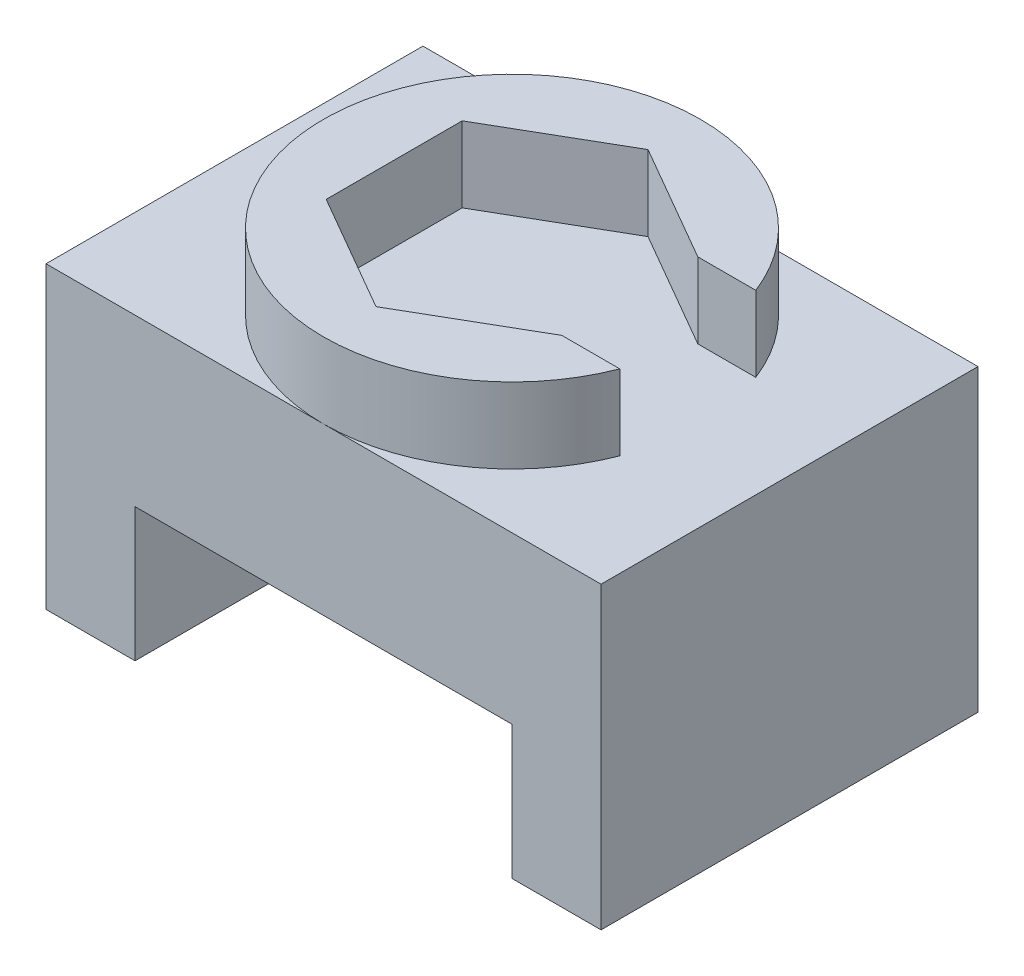
ISO-10303-21;
HEADER;
FILE_DESCRIPTION(('STEP AP214'),'2;1');
FILE_NAME('part.step','',(''),(''),'','','');
FILE_SCHEMA(('AUTOMOTIVE_DESIGN { 1 0 10303 214 1 1 1 1 }'));
ENDSEC;
DATA;
#1=APPLICATION_CONTEXT('core data for automotive mechanical design processes');
#2=APPLICATION_PROTOCOL_DEFINITION('international standard','automotive_design',2000,#1);
#3=PRODUCT_CONTEXT('',#1,'mechanical');
#4=PRODUCT('Part','Part','',(#3));
#5=PRODUCT_RELATED_PRODUCT_CATEGORY('part','',(#4));
#6=PRODUCT_DEFINITION_FORMATION('','',#4);
#7=PRODUCT_DEFINITION_CONTEXT('part definition',#1,'design');
#8=PRODUCT_DEFINITION('design','',#6,#7);
#9=PRODUCT_DEFINITION_SHAPE('','',#8);
#10=(LENGTH_UNIT() NAMED_UNIT(*) SI_UNIT(.MILLI.,.METRE.));
#11=(NAMED_UNIT(*) PLANE_ANGLE_UNIT() SI_UNIT($,.RADIAN.));
#12=(NAMED_UNIT(*) SI_UNIT($,.STERADIAN.) SOLID_ANGLE_UNIT());
#13=UNCERTAINTY_MEASURE_WITH_UNIT(LENGTH_MEASURE(1.E-05),#10,'distance_accuracy_value','');
#14=(GEOMETRIC_REPRESENTATION_CONTEXT(3) GLOBAL_UNCERTAINTY_ASSIGNED_CONTEXT((#13)) GLOBAL_UNIT_ASSIGNED_CONTEXT((#10,
#11,#12)) REPRESENTATION_CONTEXT('',''));
#15=CARTESIAN_POINT('',(0.,0.,0.));
#16=DIRECTION('',(0.,0.,1.));
#17=DIRECTION('',(1.,0.,0.));
#18=AXIS2_PLACEMENT_3D('',#15,#16,#17);
#19=CARTESIAN_POINT('',(21.2104651162791,20.17346,25.4));
#20=DIRECTION('',(0.,-1.,0.));
#21=DIRECTION('',(1.,0.,0.));
#22=AXIS2_PLACEMENT_3D('',#19,#20,#21);
#23=PLANE('',#22);
#24=CARTESIAN_POINT('',(2.51046511627907,20.17346,12.7));
#25=DIRECTION('',(0.,1.,0.));
#26=DIRECTION('',(-1.,0.,0.));
#27=AXIS2_PLACEMENT_3D('',#24,#25,#26);
#28=CIRCLE('',#27,12.7);
#29=CARTESIAN_POINT('',(14.3548181132421,20.17346,8.11728223830734));
#30=VERTEX_POINT('',#29);
#31=CARTESIAN_POINT('',(2.51046511627907,20.17346,0.));
#32=VERTEX_POINT('',#31);
#33=EDGE_CURVE('E50',#30,#32,#28,.T.);
#34=ORIENTED_EDGE('',*,*,#33,.F.);
#35=DIRECTION('',(-1.,0.,0.));
#36=VECTOR('',#35,1.);
#37=CARTESIAN_POINT('',(0.,20.17346,8.11728223830734));
#38=LINE('',#37,#36);
#39=CARTESIAN_POINT('',(10.4479651162791,20.17346,8.11728223830734));
#40=VERTEX_POINT('',#39);
#41=EDGE_CURVE('E61',#30,#40,#38,.T.);
#42=ORIENTED_EDGE('',*,*,#41,.T.);
#43=DIRECTION('',(-0.866025403784439,0.,-0.5));
#44=VECTOR('',#43,1.);
#45=CARTESIAN_POINT('',(-0.902895034961415,20.17346,1.56386007445484));
#46=LINE('',#45,#44);
#47=CARTESIAN_POINT('',(2.51046511627908,20.17346,3.53456447661468));
#48=VERTEX_POINT('',#47);
#49=EDGE_CURVE('E264',#40,#48,#46,.T.);
#50=ORIENTED_EDGE('',*,*,#49,.T.);
#51=DIRECTION('',(-0.866025403784439,0.,0.5));
#52=VECTOR('',#51,1.);
#53=CARTESIAN_POINT('',(2.15812759310095,20.17346,3.73798664046718));
#54=LINE('',#53,#52);
#55=CARTESIAN_POINT('',(-5.42703488372092,20.17346,8.11728223830733));
#56=VERTEX_POINT('',#55);
#57=EDGE_CURVE('E262',#48,#56,#54,.T.);
#58=ORIENTED_EDGE('',*,*,#57,.T.);
#59=DIRECTION('',(0.,0.,1.));
#60=VECTOR('',#59,1.);
#61=CARTESIAN_POINT('',(-5.42703488372092,20.17346,0.));
#62=LINE('',#61,#60);
#63=CARTESIAN_POINT('',(-5.42703488372092,20.17346,17.2827177616926));
#64=VERTEX_POINT('',#63);
#65=EDGE_CURVE('E260',#56,#64,#62,.T.);
#66=ORIENTED_EDGE('',*,*,#65,.T.);
#67=DIRECTION('',(0.866025403784439,0.,0.5));
#68=VECTOR('',#67,1.);
#69=CARTESIAN_POINT('',(-8.84039503496141,20.17346,15.3120133595328));
#70=LINE('',#69,#68);
#71=CARTESIAN_POINT('',(2.51046511627908,20.17346,21.8654355233853));
#72=VERTEX_POINT('',#71);
#73=EDGE_CURVE('E256',#64,#72,#70,.T.);
#74=ORIENTED_EDGE('',*,*,#73,.T.);
#75=DIRECTION('',(0.866025403784439,0.,-0.5));
#76=VECTOR('',#75,1.);
#77=CARTESIAN_POINT('',(10.095627593101,20.17346,17.4861399255452));
#78=LINE('',#77,#76);
#79=CARTESIAN_POINT('',(10.4479651162791,20.17346,17.2827177616927));
#80=VERTEX_POINT('',#79);
#81=EDGE_CURVE('E255',#72,#80,#78,.T.);
#82=ORIENTED_EDGE('',*,*,#81,.T.);
#83=DIRECTION('',(-1.,0.,0.));
#84=VECTOR('',#83,1.);
#85=CARTESIAN_POINT('',(0.,20.17346,17.2827177616927));
#86=LINE('',#85,#84);
#87=CARTESIAN_POINT('',(14.3548181132421,20.17346,17.2827177616927));
#88=VERTEX_POINT('',#87);
#89=EDGE_CURVE('E254',#88,#80,#86,.T.);
#90=ORIENTED_EDGE('',*,*,#89,.F.);
#91=CARTESIAN_POINT('',(2.51046511627907,20.17346,25.4));
#92=VERTEX_POINT('',#91);
#93=EDGE_CURVE('E48',#92,#88,#28,.T.);
#94=ORIENTED_EDGE('',*,*,#93,.F.);
#95=DIRECTION('',(-1.,0.,0.));
#96=VECTOR('',#95,1.);
#97=CARTESIAN_POINT('',(21.2104651162791,20.17346,25.4));
#98=LINE('',#97,#96);
#99=CARTESIAN_POINT('',(21.2104651162791,20.17346,25.4));
#100=VERTEX_POINT('',#99);
#101=EDGE_CURVE('E208',#100,#92,#98,.T.);
#102=ORIENTED_EDGE('',*,*,#101,.F.);
#103=DIRECTION('',(0.,0.,-1.));
#104=VECTOR('',#103,1.);
#105=CARTESIAN_POINT('',(21.2104651162791,20.17346,25.4));
#106=LINE('',#105,#104);
#107=CARTESIAN_POINT('',(21.2104651162791,20.17346,0.));
#108=VERTEX_POINT('',#107);
#109=EDGE_CURVE('E232',#100,#108,#106,.T.);
#110=ORIENTED_EDGE('',*,*,#109,.T.);
#111=DIRECTION('',(-1.,0.,0.));
#112=VECTOR('',#111,1.);
#113=CARTESIAN_POINT('',(21.2104651162791,20.17346,0.));
#114=LINE('',#113,#112);
#115=EDGE_CURVE('E224',#108,#32,#114,.T.);
#116=ORIENTED_EDGE('',*,*,#115,.T.);
#117=EDGE_LOOP('',(#34,#42,#50,#58,#66,#74,#82,#90,#94,#102,#110,#116));
#118=FACE_BOUND('',#117,.T.);
#119=ADVANCED_FACE('F39',(#118),#23,.F.);
#120=EDGE_CURVE('E11',#32,#92,#28,.T.);
#121=ORIENTED_EDGE('',*,*,#120,.F.);
#122=CARTESIAN_POINT('',(-16.1895348837209,20.17346,0.));
#123=VERTEX_POINT('',#122);
#124=EDGE_CURVE('E223',#32,#123,#114,.T.);
#125=ORIENTED_EDGE('',*,*,#124,.T.);
#126=DIRECTION('',(0.,0.,-1.));
#127=VECTOR('',#126,1.);
#128=CARTESIAN_POINT('',(-16.1895348837209,20.17346,25.4));
#129=LINE('',#128,#127);
#130=CARTESIAN_POINT('',(-16.1895348837209,20.17346,25.4));
#131=VERTEX_POINT('',#130);
#132=EDGE_CURVE('E229',#131,#123,#129,.T.);
#133=ORIENTED_EDGE('',*,*,#132,.F.);
#134=EDGE_CURVE('E207',#92,#131,#98,.T.);
#135=ORIENTED_EDGE('',*,*,#134,.F.);
#136=EDGE_LOOP('',(#121,#125,#133,#135));
#137=FACE_BOUND('',#136,.T.);
#138=ADVANCED_FACE('F322',(#137),#23,.F.);
#139=CARTESIAN_POINT('',(-16.1895348837209,0.,25.4));
#140=DIRECTION('',(0.,1.,0.));
#141=DIRECTION('',(0.,0.,1.));
#142=AXIS2_PLACEMENT_3D('',#139,#140,#141);
#143=PLANE('',#142);
#144=DIRECTION('',(1.,0.,0.));
#145=VECTOR('',#144,1.);
#146=CARTESIAN_POINT('',(-16.1895348837209,0.,0.));
#147=LINE('',#146,#145);
#148=CARTESIAN_POINT('',(-16.1895348837209,0.,0.));
#149=VERTEX_POINT('',#148);
#150=CARTESIAN_POINT('',(-10.1895348837209,0.,0.));
#151=VERTEX_POINT('',#150);
#152=EDGE_CURVE('E184',#149,#151,#147,.T.);
#153=ORIENTED_EDGE('',*,*,#152,.T.);
#154=DIRECTION('',(0.,0.,-1.));
#155=VECTOR('',#154,1.);
#156=CARTESIAN_POINT('',(-10.1895348837209,0.,25.4));
#157=LINE('',#156,#155);
#158=CARTESIAN_POINT('',(-10.1895348837209,0.,25.4));
#159=VERTEX_POINT('',#158);
#160=EDGE_CURVE('E43',#159,#151,#157,.T.);
#161=ORIENTED_EDGE('',*,*,#160,.F.);
#162=DIRECTION('',(1.,0.,0.));
#163=VECTOR('',#162,1.);
#164=CARTESIAN_POINT('',(-16.1895348837209,0.,25.4));
#165=LINE('',#164,#163);
#166=CARTESIAN_POINT('',(-16.1895348837209,0.,25.4));
#167=VERTEX_POINT('',#166);
#168=EDGE_CURVE('E193',#167,#159,#165,.T.);
#169=ORIENTED_EDGE('',*,*,#168,.F.);
#170=DIRECTION('',(0.,0.,-1.));
#171=VECTOR('',#170,1.);
#172=CARTESIAN_POINT('',(-16.1895348837209,0.,25.4));
#173=LINE('',#172,#171);
#174=EDGE_CURVE('E212',#167,#149,#173,.T.);
#175=ORIENTED_EDGE('',*,*,#174,.T.);
#176=EDGE_LOOP('',(#153,#161,#169,#175));
#177=FACE_BOUND('',#176,.T.);
#178=ADVANCED_FACE('F41',(#177),#143,.F.);
#179=CARTESIAN_POINT('',(-10.1895348837209,0.,25.4));
#180=DIRECTION('',(-1.,0.,0.));
#181=DIRECTION('',(0.,0.,1.));
#182=AXIS2_PLACEMENT_3D('',#179,#180,#181);
#183=PLANE('',#182);
#184=DIRECTION('',(0.,1.,0.));
#185=VECTOR('',#184,1.);
#186=CARTESIAN_POINT('',(-10.1895348837209,0.,0.));
#187=LINE('',#186,#185);
#188=CARTESIAN_POINT('',(-10.1895348837209,9.,0.));
#189=VERTEX_POINT('',#188);
#190=EDGE_CURVE('E187',#151,#189,#187,.T.);
#191=ORIENTED_EDGE('',*,*,#190,.T.);
#192=DIRECTION('',(0.,0.,-1.));
#193=VECTOR('',#192,1.);
#194=CARTESIAN_POINT('',(-10.1895348837209,9.,25.4));
#195=LINE('',#194,#193);
#196=CARTESIAN_POINT('',(-10.1895348837209,9.,25.4));
#197=VERTEX_POINT('',#196);
#198=EDGE_CURVE('E243',#197,#189,#195,.T.);
#199=ORIENTED_EDGE('',*,*,#198,.F.);
#200=DIRECTION('',(0.,1.,0.));
#201=VECTOR('',#200,1.);
#202=CARTESIAN_POINT('',(-10.1895348837209,0.,25.4));
#203=LINE('',#202,#201);
#204=EDGE_CURVE('E196',#159,#197,#203,.T.);
#205=ORIENTED_EDGE('',*,*,#204,.F.);
#206=ORIENTED_EDGE('',*,*,#160,.T.);
#207=EDGE_LOOP('',(#191,#199,#205,#206));
#208=FACE_BOUND('',#207,.T.);
#209=ADVANCED_FACE('F346',(#208),#183,.F.);
#210=CARTESIAN_POINT('',(-10.1895348837209,9.,25.4));
#211=DIRECTION('',(0.,1.,0.));
#212=DIRECTION('',(0.,0.,1.));
#213=AXIS2_PLACEMENT_3D('',#210,#211,#212);
#214=PLANE('',#213);
#215=DIRECTION('',(1.,0.,0.));
#216=VECTOR('',#215,1.);
#217=CARTESIAN_POINT('',(-10.1895348837209,9.,0.));
#218=LINE('',#217,#216);
#219=CARTESIAN_POINT('',(15.2104651162791,9.,0.));
#220=VERTEX_POINT('',#219);
#221=EDGE_CURVE('E215',#189,#220,#218,.T.);
#222=ORIENTED_EDGE('',*,*,#221,.T.);
#223=DIRECTION('',(0.,0.,-1.));
#224=VECTOR('',#223,1.);
#225=CARTESIAN_POINT('',(15.2104651162791,9.,25.4));
#226=LINE('',#225,#224);
#227=CARTESIAN_POINT('',(15.2104651162791,9.,25.4));
#228=VERTEX_POINT('',#227);
#229=EDGE_CURVE('E241',#228,#220,#226,.T.);
#230=ORIENTED_EDGE('',*,*,#229,.F.);
#231=DIRECTION('',(1.,0.,0.));
#232=VECTOR('',#231,1.);
#233=CARTESIAN_POINT('',(-10.1895348837209,9.,25.4));
#234=LINE('',#233,#232);
#235=EDGE_CURVE('E199',#197,#228,#234,.T.);
#236=ORIENTED_EDGE('',*,*,#235,.F.);
#237=ORIENTED_EDGE('',*,*,#198,.T.);
#238=EDGE_LOOP('',(#222,#230,#236,#237));
#239=FACE_BOUND('',#238,.T.);
#240=ADVANCED_FACE('F343',(#239),#214,.F.);
#241=CARTESIAN_POINT('',(15.2104651162791,9.,25.4));
#242=DIRECTION('',(1.,0.,0.));
#243=DIRECTION('',(0.,1.,0.));
#244=AXIS2_PLACEMENT_3D('',#241,#242,#243);
#245=PLANE('',#244);
#246=DIRECTION('',(0.,-1.,0.));
#247=VECTOR('',#246,1.);
#248=CARTESIAN_POINT('',(15.2104651162791,9.,0.));
#249=LINE('',#248,#247);
#250=CARTESIAN_POINT('',(15.2104651162791,0.,0.));
#251=VERTEX_POINT('',#250);
#252=EDGE_CURVE('E217',#220,#251,#249,.T.);
#253=ORIENTED_EDGE('',*,*,#252,.T.);
#254=DIRECTION('',(0.,0.,-1.));
#255=VECTOR('',#254,1.);
#256=CARTESIAN_POINT('',(15.2104651162791,0.,25.4));
#257=LINE('',#256,#255);
#258=CARTESIAN_POINT('',(15.2104651162791,0.,25.4));
#259=VERTEX_POINT('',#258);
#260=EDGE_CURVE('E238',#259,#251,#257,.T.);
#261=ORIENTED_EDGE('',*,*,#260,.F.);
#262=DIRECTION('',(0.,-1.,0.));
#263=VECTOR('',#262,1.);
#264=CARTESIAN_POINT('',(15.2104651162791,9.,25.4));
#265=LINE('',#264,#263);
#266=EDGE_CURVE('E201',#228,#259,#265,.T.);
#267=ORIENTED_EDGE('',*,*,#266,.F.);
#268=ORIENTED_EDGE('',*,*,#229,.T.);
#269=EDGE_LOOP('',(#253,#261,#267,#268));
#270=FACE_BOUND('',#269,.T.);
#271=ADVANCED_FACE('F339',(#270),#245,.F.);
#272=CARTESIAN_POINT('',(15.2104651162791,0.,25.4));
#273=DIRECTION('',(0.,1.,0.));
#274=DIRECTION('',(0.,0.,1.));
#275=AXIS2_PLACEMENT_3D('',#272,#273,#274);
#276=PLANE('',#275);
#277=DIRECTION('',(1.,0.,0.));
#278=VECTOR('',#277,1.);
#279=CARTESIAN_POINT('',(15.2104651162791,0.,0.));
#280=LINE('',#279,#278);
#281=CARTESIAN_POINT('',(21.2104651162791,0.,0.));
#282=VERTEX_POINT('',#281);
#283=EDGE_CURVE('E219',#251,#282,#280,.T.);
#284=ORIENTED_EDGE('',*,*,#283,.T.);
#285=DIRECTION('',(0.,0.,-1.));
#286=VECTOR('',#285,1.);
#287=CARTESIAN_POINT('',(21.2104651162791,0.,25.4));
#288=LINE('',#287,#286);
#289=CARTESIAN_POINT('',(21.2104651162791,0.,25.4));
#290=VERTEX_POINT('',#289);
#291=EDGE_CURVE('E235',#290,#282,#288,.T.);
#292=ORIENTED_EDGE('',*,*,#291,.F.);
#293=DIRECTION('',(1.,0.,0.));
#294=VECTOR('',#293,1.);
#295=CARTESIAN_POINT('',(15.2104651162791,0.,25.4));
#296=LINE('',#295,#294);
#297=EDGE_CURVE('E203',#259,#290,#296,.T.);
#298=ORIENTED_EDGE('',*,*,#297,.F.);
#299=ORIENTED_EDGE('',*,*,#260,.T.);
#300=EDGE_LOOP('',(#284,#292,#298,#299));
#301=FACE_BOUND('',#300,.T.);
#302=ADVANCED_FACE('F335',(#301),#276,.F.);
#303=CARTESIAN_POINT('',(21.2104651162791,0.,25.4));
#304=DIRECTION('',(-1.,0.,0.));
#305=DIRECTION('',(0.,0.,1.));
#306=AXIS2_PLACEMENT_3D('',#303,#304,#305);
#307=PLANE('',#306);
#308=DIRECTION('',(0.,1.,0.));
#309=VECTOR('',#308,1.);
#310=CARTESIAN_POINT('',(21.2104651162791,0.,0.));
#311=LINE('',#310,#309);
#312=EDGE_CURVE('E221',#282,#108,#311,.T.);
#313=ORIENTED_EDGE('',*,*,#312,.T.);
#314=ORIENTED_EDGE('',*,*,#109,.F.);
#315=DIRECTION('',(0.,1.,0.));
#316=VECTOR('',#315,1.);
#317=CARTESIAN_POINT('',(21.2104651162791,0.,25.4));
#318=LINE('',#317,#316);
#319=EDGE_CURVE('E205',#290,#100,#318,.T.);
#320=ORIENTED_EDGE('',*,*,#319,.F.);
#321=ORIENTED_EDGE('',*,*,#291,.T.);
#322=EDGE_LOOP('',(#313,#314,#320,#321));
#323=FACE_BOUND('',#322,.T.);
#324=ADVANCED_FACE('F332',(#323),#307,.F.);
#325=CARTESIAN_POINT('',(-16.1895348837209,20.17346,25.4));
#326=DIRECTION('',(1.,0.,0.));
#327=DIRECTION('',(0.,1.,0.));
#328=AXIS2_PLACEMENT_3D('',#325,#326,#327);
#329=PLANE('',#328);
#330=DIRECTION('',(0.,-1.,0.));
#331=VECTOR('',#330,1.);
#332=CARTESIAN_POINT('',(-16.1895348837209,20.17346,0.));
#333=LINE('',#332,#331);
#334=EDGE_CURVE('E197',#123,#149,#333,.T.);
#335=ORIENTED_EDGE('',*,*,#334,.T.);
#336=ORIENTED_EDGE('',*,*,#174,.F.);
#337=DIRECTION('',(0.,-1.,0.));
#338=VECTOR('',#337,1.);
#339=CARTESIAN_POINT('',(-16.1895348837209,20.17346,25.4));
#340=LINE('',#339,#338);
#341=EDGE_CURVE('E211',#131,#167,#340,.T.);
#342=ORIENTED_EDGE('',*,*,#341,.F.);
#343=ORIENTED_EDGE('',*,*,#132,.T.);
#344=EDGE_LOOP('',(#335,#336,#342,#343));
#345=FACE_BOUND('',#344,.T.);
#346=ADVANCED_FACE('F330',(#345),#329,.F.);
#347=CARTESIAN_POINT('',(0.,0.,25.4));
#348=DIRECTION('',(0.,0.,1.));
#349=DIRECTION('',(1.,0.,0.));
#350=AXIS2_PLACEMENT_3D('',#347,#348,#349);
#351=PLANE('',#350);
#352=ORIENTED_EDGE('',*,*,#168,.T.);
#353=ORIENTED_EDGE('',*,*,#204,.T.);
#354=ORIENTED_EDGE('',*,*,#235,.T.);
#355=ORIENTED_EDGE('',*,*,#266,.T.);
#356=ORIENTED_EDGE('',*,*,#297,.T.);
#357=ORIENTED_EDGE('',*,*,#319,.T.);
#358=ORIENTED_EDGE('',*,*,#101,.T.);
#359=ORIENTED_EDGE('',*,*,#134,.T.);
#360=ORIENTED_EDGE('',*,*,#341,.T.);
#361=EDGE_LOOP('',(#352,#353,#354,#355,#356,#357,#358,#359,#360));
#362=FACE_BOUND('',#361,.T.);
#363=ADVANCED_FACE('F363',(#362),#351,.T.);
#364=CARTESIAN_POINT('',(0.,0.,0.));
#365=DIRECTION('',(0.,0.,1.));
#366=DIRECTION('',(1.,0.,0.));
#367=AXIS2_PLACEMENT_3D('',#364,#365,#366);
#368=PLANE('',#367);
#369=ORIENTED_EDGE('',*,*,#152,.F.);
#370=ORIENTED_EDGE('',*,*,#334,.F.);
#371=ORIENTED_EDGE('',*,*,#124,.F.);
#372=ORIENTED_EDGE('',*,*,#115,.F.);
#373=ORIENTED_EDGE('',*,*,#312,.F.);
#374=ORIENTED_EDGE('',*,*,#283,.F.);
#375=ORIENTED_EDGE('',*,*,#252,.F.);
#376=ORIENTED_EDGE('',*,*,#221,.F.);
#377=ORIENTED_EDGE('',*,*,#190,.F.);
#378=EDGE_LOOP('',(#369,#370,#371,#372,#373,#374,#375,#376,#377));
#379=FACE_BOUND('',#378,.T.);
#380=ADVANCED_FACE('F354',(#379),#368,.F.);
#381=CARTESIAN_POINT('',(2.51046511627907,25.25346,12.7));
#382=DIRECTION('',(0.,-1.,0.));
#383=DIRECTION('',(1.,0.,0.));
#384=AXIS2_PLACEMENT_3D('',#381,#382,#383);
#385=CYLINDRICAL_SURFACE('',#384,12.7);
#386=ORIENTED_EDGE('',*,*,#33,.T.);
#387=ORIENTED_EDGE('',*,*,#120,.T.);
#388=ORIENTED_EDGE('',*,*,#93,.T.);
#389=DIRECTION('',(0.,-1.,0.));
#390=VECTOR('',#389,1.);
#391=CARTESIAN_POINT('',(14.3548181132421,25.25346,17.2827177616927));
#392=LINE('',#391,#390);
#393=CARTESIAN_POINT('',(14.3548181132421,25.25346,17.2827177616927));
#394=VERTEX_POINT('',#393);
#395=EDGE_CURVE('E165',#394,#88,#392,.T.);
#396=ORIENTED_EDGE('',*,*,#395,.F.);
#397=CARTESIAN_POINT('',(2.51046511627907,25.25346,12.7));
#398=DIRECTION('',(0.,1.,0.));
#399=DIRECTION('',(-1.,0.,0.));
#400=AXIS2_PLACEMENT_3D('',#397,#398,#399);
#401=CIRCLE('',#400,12.7);
#402=CARTESIAN_POINT('',(14.3548181132421,25.25346,8.11728223830734));
#403=VERTEX_POINT('',#402);
#404=EDGE_CURVE('E172',#403,#394,#401,.T.);
#405=ORIENTED_EDGE('',*,*,#404,.F.);
#406=DIRECTION('',(0.,-1.,0.));
#407=VECTOR('',#406,1.);
#408=CARTESIAN_POINT('',(14.3548181132421,25.25346,8.11728223830734));
#409=LINE('',#408,#407);
#410=EDGE_CURVE('E267',#403,#30,#409,.T.);
#411=ORIENTED_EDGE('',*,*,#410,.T.);
#412=EDGE_LOOP('',(#386,#387,#388,#396,#405,#411));
#413=FACE_BOUND('',#412,.T.);
#414=ADVANCED_FACE('F183',(#413),#385,.T.);
#415=CARTESIAN_POINT('',(0.,25.25346,17.2827177616927));
#416=DIRECTION('',(0.,0.,1.));
#417=DIRECTION('',(1.,0.,0.));
#418=AXIS2_PLACEMENT_3D('',#415,#416,#417);
#419=PLANE('',#418);
#420=ORIENTED_EDGE('',*,*,#89,.T.);
#421=DIRECTION('',(0.,-1.,0.));
#422=VECTOR('',#421,1.);
#423=CARTESIAN_POINT('',(10.4479651162791,25.25346,17.2827177616927));
#424=LINE('',#423,#422);
#425=CARTESIAN_POINT('',(10.4479651162791,25.25346,17.2827177616927));
#426=VERTEX_POINT('',#425);
#427=EDGE_CURVE('E167',#426,#80,#424,.T.);
#428=ORIENTED_EDGE('',*,*,#427,.F.);
#429=DIRECTION('',(-1.,0.,0.));
#430=VECTOR('',#429,1.);
#431=CARTESIAN_POINT('',(0.,25.25346,17.2827177616927));
#432=LINE('',#431,#430);
#433=EDGE_CURVE('E160',#394,#426,#432,.T.);
#434=ORIENTED_EDGE('',*,*,#433,.F.);
#435=ORIENTED_EDGE('',*,*,#395,.T.);
#436=EDGE_LOOP('',(#420,#428,#434,#435));
#437=FACE_BOUND('',#436,.T.);
#438=ADVANCED_FACE('F163',(#437),#419,.F.);
#439=CARTESIAN_POINT('',(10.095627593101,25.25346,17.4861399255452));
#440=DIRECTION('',(-0.5,0.,-0.866025403784439));
#441=DIRECTION('',(-0.866025403784439,0.,0.5));
#442=AXIS2_PLACEMENT_3D('',#439,#440,#441);
#443=PLANE('',#442);
#444=ORIENTED_EDGE('',*,*,#81,.F.);
#445=DIRECTION('',(0.,-1.,0.));
#446=VECTOR('',#445,1.);
#447=CARTESIAN_POINT('',(2.51046511627908,25.25346,21.8654355233853));
#448=LINE('',#447,#446);
#449=CARTESIAN_POINT('',(2.51046511627908,25.25346,21.8654355233853));
#450=VERTEX_POINT('',#449);
#451=EDGE_CURVE('E189',#450,#72,#448,.T.);
#452=ORIENTED_EDGE('',*,*,#451,.F.);
#453=DIRECTION('',(0.866025403784439,0.,-0.5));
#454=VECTOR('',#453,1.);
#455=CARTESIAN_POINT('',(10.095627593101,25.25346,17.4861399255452));
#456=LINE('',#455,#454);
#457=EDGE_CURVE('E171',#450,#426,#456,.T.);
#458=ORIENTED_EDGE('',*,*,#457,.T.);
#459=ORIENTED_EDGE('',*,*,#427,.T.);
#460=EDGE_LOOP('',(#444,#452,#458,#459));
#461=FACE_BOUND('',#460,.T.);
#462=ADVANCED_FACE('F288',(#461),#443,.T.);
#463=CARTESIAN_POINT('',(-8.84039503496141,25.25346,15.3120133595328));
#464=DIRECTION('',(0.5,0.,-0.866025403784439));
#465=DIRECTION('',(-0.866025403784439,0.,-0.5));
#466=AXIS2_PLACEMENT_3D('',#463,#464,#465);
#467=PLANE('',#466);
#468=ORIENTED_EDGE('',*,*,#73,.F.);
#469=DIRECTION('',(0.,-1.,0.));
#470=VECTOR('',#469,1.);
#471=CARTESIAN_POINT('',(-5.42703488372093,25.25346,17.2827177616926));
#472=LINE('',#471,#470);
#473=CARTESIAN_POINT('',(-5.42703488372093,25.25346,17.2827177616926));
#474=VERTEX_POINT('',#473);
#475=EDGE_CURVE('E277',#474,#64,#472,.T.);
#476=ORIENTED_EDGE('',*,*,#475,.F.);
#477=DIRECTION('',(0.866025403784439,0.,0.5));
#478=VECTOR('',#477,1.);
#479=CARTESIAN_POINT('',(-8.84039503496141,25.25346,15.3120133595328));
#480=LINE('',#479,#478);
#481=EDGE_CURVE('E286',#474,#450,#480,.T.);
#482=ORIENTED_EDGE('',*,*,#481,.T.);
#483=ORIENTED_EDGE('',*,*,#451,.T.);
#484=EDGE_LOOP('',(#468,#476,#482,#483));
#485=FACE_BOUND('',#484,.T.);
#486=ADVANCED_FACE('F284',(#485),#467,.T.);
#487=CARTESIAN_POINT('',(-5.42703488372092,25.25346,0.));
#488=DIRECTION('',(1.,0.,0.));
#489=DIRECTION('',(0.,0.,-1.));
#490=AXIS2_PLACEMENT_3D('',#487,#488,#489);
#491=PLANE('',#490);
#492=ORIENTED_EDGE('',*,*,#65,.F.);
#493=DIRECTION('',(0.,-1.,0.));
#494=VECTOR('',#493,1.);
#495=CARTESIAN_POINT('',(-5.42703488372092,25.25346,8.11728223830733));
#496=LINE('',#495,#494);
#497=CARTESIAN_POINT('',(-5.42703488372092,25.25346,8.11728223830733));
#498=VERTEX_POINT('',#497);
#499=EDGE_CURVE('E274',#498,#56,#496,.T.);
#500=ORIENTED_EDGE('',*,*,#499,.F.);
#501=DIRECTION('',(0.,0.,1.));
#502=VECTOR('',#501,1.);
#503=CARTESIAN_POINT('',(-5.42703488372092,25.25346,0.));
#504=LINE('',#503,#502);
#505=EDGE_CURVE('E295',#498,#474,#504,.T.);
#506=ORIENTED_EDGE('',*,*,#505,.T.);
#507=ORIENTED_EDGE('',*,*,#475,.T.);
#508=EDGE_LOOP('',(#492,#500,#506,#507));
#509=FACE_BOUND('',#508,.T.);
#510=ADVANCED_FACE('F293',(#509),#491,.T.);
#511=CARTESIAN_POINT('',(2.15812759310095,25.25346,3.73798664046718));
#512=DIRECTION('',(0.5,0.,0.866025403784439));
#513=DIRECTION('',(0.866025403784439,0.,-0.5));
#514=AXIS2_PLACEMENT_3D('',#511,#512,#513);
#515=PLANE('',#514);
#516=ORIENTED_EDGE('',*,*,#57,.F.);
#517=DIRECTION('',(0.,-1.,0.));
#518=VECTOR('',#517,1.);
#519=CARTESIAN_POINT('',(2.51046511627908,25.25346,3.53456447661468));
#520=LINE('',#519,#518);
#521=CARTESIAN_POINT('',(2.51046511627908,25.25346,3.53456447661468));
#522=VERTEX_POINT('',#521);
#523=EDGE_CURVE('E271',#522,#48,#520,.T.);
#524=ORIENTED_EDGE('',*,*,#523,.F.);
#525=DIRECTION('',(-0.866025403784439,0.,0.5));
#526=VECTOR('',#525,1.);
#527=CARTESIAN_POINT('',(2.15812759310095,25.25346,3.73798664046718));
#528=LINE('',#527,#526);
#529=EDGE_CURVE('E299',#522,#498,#528,.T.);
#530=ORIENTED_EDGE('',*,*,#529,.T.);
#531=ORIENTED_EDGE('',*,*,#499,.T.);
#532=EDGE_LOOP('',(#516,#524,#530,#531));
#533=FACE_BOUND('',#532,.T.);
#534=ADVANCED_FACE('F312',(#533),#515,.T.);
#535=CARTESIAN_POINT('',(-0.902895034961415,25.25346,1.56386007445484));
#536=DIRECTION('',(-0.5,0.,0.866025403784438));
#537=DIRECTION('',(0.866025403784439,0.,0.5));
#538=AXIS2_PLACEMENT_3D('',#535,#536,#537);
#539=PLANE('',#538);
#540=ORIENTED_EDGE('',*,*,#49,.F.);
#541=DIRECTION('',(0.,-1.,0.));
#542=VECTOR('',#541,1.);
#543=CARTESIAN_POINT('',(10.4479651162791,25.25346,8.11728223830734));
#544=LINE('',#543,#542);
#545=CARTESIAN_POINT('',(10.4479651162791,25.25346,8.11728223830734));
#546=VERTEX_POINT('',#545);
#547=EDGE_CURVE('E269',#546,#40,#544,.T.);
#548=ORIENTED_EDGE('',*,*,#547,.F.);
#549=DIRECTION('',(-0.866025403784439,0.,-0.5));
#550=VECTOR('',#549,1.);
#551=CARTESIAN_POINT('',(-0.902895034961415,25.25346,1.56386007445484));
#552=LINE('',#551,#550);
#553=EDGE_CURVE('E304',#546,#522,#552,.T.);
#554=ORIENTED_EDGE('',*,*,#553,.T.);
#555=ORIENTED_EDGE('',*,*,#523,.T.);
#556=EDGE_LOOP('',(#540,#548,#554,#555));
#557=FACE_BOUND('',#556,.T.);
#558=ADVANCED_FACE('F310',(#557),#539,.T.);
#559=CARTESIAN_POINT('',(0.,25.25346,8.11728223830734));
#560=DIRECTION('',(0.,0.,1.));
#561=DIRECTION('',(1.,0.,0.));
#562=AXIS2_PLACEMENT_3D('',#559,#560,#561);
#563=PLANE('',#562);
#564=ORIENTED_EDGE('',*,*,#41,.F.);
#565=ORIENTED_EDGE('',*,*,#410,.F.);
#566=DIRECTION('',(-1.,0.,0.));
#567=VECTOR('',#566,1.);
#568=CARTESIAN_POINT('',(0.,25.25346,8.11728223830734));
#569=LINE('',#568,#567);
#570=EDGE_CURVE('E179',#403,#546,#569,.T.);
#571=ORIENTED_EDGE('',*,*,#570,.T.);
#572=ORIENTED_EDGE('',*,*,#547,.T.);
#573=EDGE_LOOP('',(#564,#565,#571,#572));
#574=FACE_BOUND('',#573,.T.);
#575=ADVANCED_FACE('F307',(#574),#563,.T.);
#576=CARTESIAN_POINT('',(0.,25.25346,0.));
#577=DIRECTION('',(0.,1.,0.));
#578=DIRECTION('',(-1.,0.,0.));
#579=AXIS2_PLACEMENT_3D('',#576,#577,#578);
#580=PLANE('',#579);
#581=ORIENTED_EDGE('',*,*,#404,.T.);
#582=ORIENTED_EDGE('',*,*,#433,.T.);
#583=ORIENTED_EDGE('',*,*,#457,.F.);
#584=ORIENTED_EDGE('',*,*,#481,.F.);
#585=ORIENTED_EDGE('',*,*,#505,.F.);
#586=ORIENTED_EDGE('',*,*,#529,.F.);
#587=ORIENTED_EDGE('',*,*,#553,.F.);
#588=ORIENTED_EDGE('',*,*,#570,.F.);
#589=EDGE_LOOP('',(#581,#582,#583,#584,#585,#586,#587,#588));
#590=FACE_BOUND('',#589,.T.);
#591=ADVANCED_FACE('F176',(#590),#580,.T.);
#592=CLOSED_SHELL('',(#119,#138,#178,#209,#240,#271,#302,#324,#346,#363,#380,#414,#438,#462,
#486,#510,#534,#558,#575,#591));
#593=MANIFOLD_SOLID_BREP('B2',#592);
#594=ADVANCED_BREP_SHAPE_REPRESENTATION('',(#18,#593),#14);
#595=SHAPE_DEFINITION_REPRESENTATION(#9,#594);
ENDSEC;
END-ISO-10303-21;
